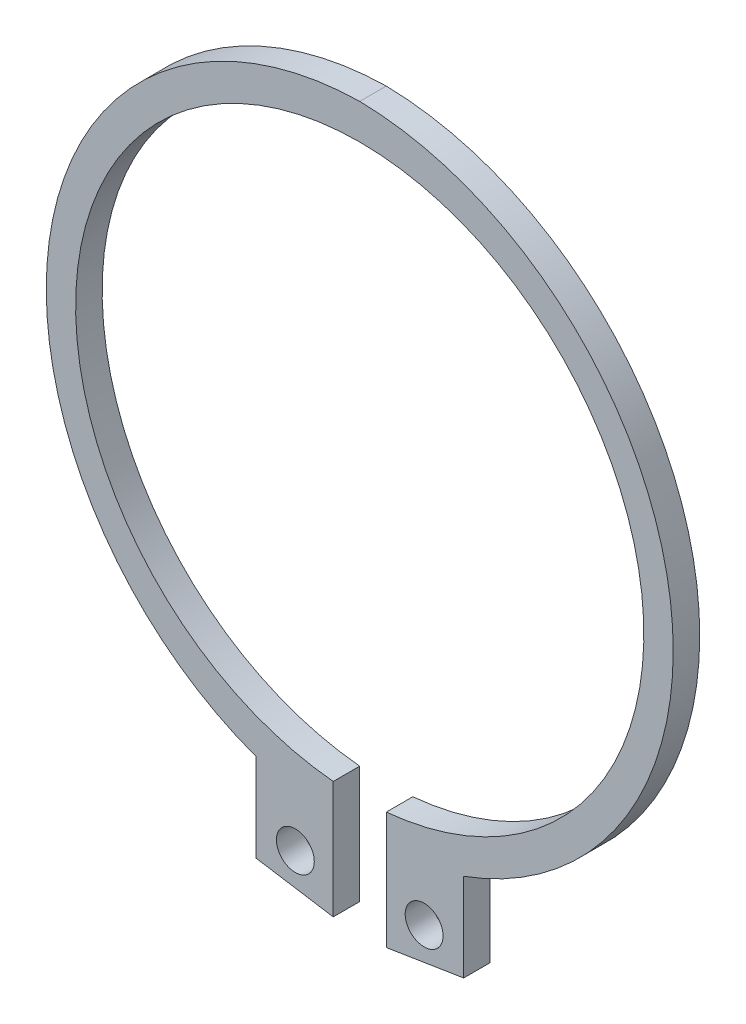
ISO-10303-21;
HEADER;
FILE_DESCRIPTION(('STEP AP214'),'2;1');
FILE_NAME('part.step','',(''),(''),'','','');
FILE_SCHEMA(('AUTOMOTIVE_DESIGN { 1 0 10303 214 1 1 1 1 }'));
ENDSEC;
DATA;
#1=APPLICATION_CONTEXT('core data for automotive mechanical design processes');
#2=APPLICATION_PROTOCOL_DEFINITION('international standard','automotive_design',2000,#1);
#3=PRODUCT_CONTEXT('',#1,'mechanical');
#4=PRODUCT('Part','Part','',(#3));
#5=PRODUCT_RELATED_PRODUCT_CATEGORY('part','',(#4));
#6=PRODUCT_DEFINITION_FORMATION('','',#4);
#7=PRODUCT_DEFINITION_CONTEXT('part definition',#1,'design');
#8=PRODUCT_DEFINITION('design','',#6,#7);
#9=PRODUCT_DEFINITION_SHAPE('','',#8);
#10=(LENGTH_UNIT() NAMED_UNIT(*) SI_UNIT(.MILLI.,.METRE.));
#11=(NAMED_UNIT(*) PLANE_ANGLE_UNIT() SI_UNIT($,.RADIAN.));
#12=(NAMED_UNIT(*) SI_UNIT($,.STERADIAN.) SOLID_ANGLE_UNIT());
#13=UNCERTAINTY_MEASURE_WITH_UNIT(LENGTH_MEASURE(1.E-05),#10,'distance_accuracy_value','');
#14=(GEOMETRIC_REPRESENTATION_CONTEXT(3) GLOBAL_UNCERTAINTY_ASSIGNED_CONTEXT((#13)) GLOBAL_UNIT_ASSIGNED_CONTEXT((#10,
#11,#12)) REPRESENTATION_CONTEXT('',''));
#15=CARTESIAN_POINT('',(0.,0.,0.));
#16=DIRECTION('',(0.,0.,1.));
#17=DIRECTION('',(1.,0.,0.));
#18=AXIS2_PLACEMENT_3D('',#15,#16,#17);
#19=CARTESIAN_POINT('',(4.25,-23.875,0.875));
#20=DIRECTION('',(0.,0.,-1.));
#21=DIRECTION('',(1.,0.,0.));
#22=AXIS2_PLACEMENT_3D('',#19,#20,#21);
#23=CYLINDRICAL_SURFACE('',#22,1.25);
#24=CARTESIAN_POINT('',(4.25,-23.875,0.));
#25=DIRECTION('',(0.,0.,1.));
#26=DIRECTION('',(1.,0.,0.));
#27=AXIS2_PLACEMENT_3D('',#24,#25,#26);
#28=CIRCLE('',#27,1.25);
#29=CARTESIAN_POINT('',(5.5,-23.875,0.));
#30=VERTEX_POINT('',#29);
#31=EDGE_CURVE('E33',#30,#30,#28,.T.);
#32=ORIENTED_EDGE('',*,*,#31,.F.);
#33=EDGE_LOOP('',(#32));
#34=FACE_BOUND('',#33,.T.);
#35=CARTESIAN_POINT('',(4.25,-23.875,1.75));
#36=DIRECTION('',(0.,0.,-1.));
#37=DIRECTION('',(1.,0.,0.));
#38=AXIS2_PLACEMENT_3D('',#35,#36,#37);
#39=CIRCLE('',#38,1.25);
#40=CARTESIAN_POINT('',(5.5,-23.875,1.75));
#41=VERTEX_POINT('',#40);
#42=EDGE_CURVE('E20',#41,#41,#39,.T.);
#43=ORIENTED_EDGE('',*,*,#42,.F.);
#44=EDGE_LOOP('',(#43));
#45=FACE_BOUND('',#44,.T.);
#46=ADVANCED_FACE('F16',(#34,#45),#23,.F.);
#47=CARTESIAN_POINT('',(-4.25,-23.875,0.875));
#48=DIRECTION('',(0.,0.,-1.));
#49=DIRECTION('',(1.,0.,0.));
#50=AXIS2_PLACEMENT_3D('',#47,#48,#49);
#51=CYLINDRICAL_SURFACE('',#50,1.25);
#52=CARTESIAN_POINT('',(-4.25,-23.875,0.));
#53=DIRECTION('',(0.,0.,1.));
#54=DIRECTION('',(1.,0.,0.));
#55=AXIS2_PLACEMENT_3D('',#52,#53,#54);
#56=CIRCLE('',#55,1.25);
#57=CARTESIAN_POINT('',(-3.,-23.875,0.));
#58=VERTEX_POINT('',#57);
#59=EDGE_CURVE('E155',#58,#58,#56,.T.);
#60=ORIENTED_EDGE('',*,*,#59,.F.);
#61=EDGE_LOOP('',(#60));
#62=FACE_BOUND('',#61,.T.);
#63=CARTESIAN_POINT('',(-4.25,-23.875,1.75));
#64=DIRECTION('',(0.,0.,-1.));
#65=DIRECTION('',(1.,0.,0.));
#66=AXIS2_PLACEMENT_3D('',#63,#64,#65);
#67=CIRCLE('',#66,1.25);
#68=CARTESIAN_POINT('',(-3.,-23.875,1.75));
#69=VERTEX_POINT('',#68);
#70=EDGE_CURVE('E139',#69,#69,#67,.T.);
#71=ORIENTED_EDGE('',*,*,#70,.F.);
#72=EDGE_LOOP('',(#71));
#73=FACE_BOUND('',#72,.T.);
#74=ADVANCED_FACE('F206',(#62,#73),#51,.F.);
#75=CARTESIAN_POINT('',(1.75,-15.,0.875));
#76=DIRECTION('',(-1.,0.,0.));
#77=DIRECTION('',(0.,0.,1.));
#78=AXIS2_PLACEMENT_3D('',#75,#76,#77);
#79=PLANE('',#78);
#80=DIRECTION('',(0.,0.,-1.));
#81=VECTOR('',#80,1.);
#82=CARTESIAN_POINT('',(1.75,-26.4102133568804,1.3125));
#83=LINE('',#82,#81);
#84=CARTESIAN_POINT('',(1.75,-26.4102133568804,1.75));
#85=VERTEX_POINT('',#84);
#86=CARTESIAN_POINT('',(1.75,-26.4102133568804,0.));
#87=VERTEX_POINT('',#86);
#88=EDGE_CURVE('E11',#85,#87,#83,.T.);
#89=ORIENTED_EDGE('',*,*,#88,.F.);
#90=DIRECTION('',(0.,-1.,0.));
#91=VECTOR('',#90,1.);
#92=CARTESIAN_POINT('',(1.75,-8.36192121621941,1.75));
#93=LINE('',#92,#91);
#94=CARTESIAN_POINT('',(1.75,-18.6681547025944,1.75));
#95=VERTEX_POINT('',#94);
#96=EDGE_CURVE('E133',#95,#85,#93,.T.);
#97=ORIENTED_EDGE('',*,*,#96,.F.);
#98=DIRECTION('',(0.,0.,1.));
#99=VECTOR('',#98,1.);
#100=CARTESIAN_POINT('',(1.75,-18.6681547025944,0.875));
#101=LINE('',#100,#99);
#102=CARTESIAN_POINT('',(1.75,-18.6681547025944,0.));
#103=VERTEX_POINT('',#102);
#104=EDGE_CURVE('E104',#103,#95,#101,.T.);
#105=ORIENTED_EDGE('',*,*,#104,.F.);
#106=DIRECTION('',(0.,1.,0.));
#107=VECTOR('',#106,1.);
#108=CARTESIAN_POINT('',(1.75,-8.36192121621941,0.));
#109=LINE('',#108,#107);
#110=EDGE_CURVE('E158',#87,#103,#109,.T.);
#111=ORIENTED_EDGE('',*,*,#110,.F.);
#112=EDGE_LOOP('',(#89,#97,#105,#111));
#113=FACE_BOUND('',#112,.T.);
#114=ADVANCED_FACE('F204',(#113),#79,.T.);
#115=CARTESIAN_POINT('',(-1.75,-15.,0.875));
#116=DIRECTION('',(1.,0.,0.));
#117=DIRECTION('',(0.,0.,-1.));
#118=AXIS2_PLACEMENT_3D('',#115,#116,#117);
#119=PLANE('',#118);
#120=DIRECTION('',(0.,0.,1.));
#121=VECTOR('',#120,1.);
#122=CARTESIAN_POINT('',(-1.75,-26.4102133568804,0.4375));
#123=LINE('',#122,#121);
#124=CARTESIAN_POINT('',(-1.75,-26.4102133568804,0.));
#125=VERTEX_POINT('',#124);
#126=CARTESIAN_POINT('',(-1.75,-26.4102133568804,1.75));
#127=VERTEX_POINT('',#126);
#128=EDGE_CURVE('E147',#125,#127,#123,.T.);
#129=ORIENTED_EDGE('',*,*,#128,.F.);
#130=DIRECTION('',(0.,-1.,0.));
#131=VECTOR('',#130,1.);
#132=CARTESIAN_POINT('',(-1.75,-8.36192121621941,0.));
#133=LINE('',#132,#131);
#134=CARTESIAN_POINT('',(-1.75,-18.6681547025944,0.));
#135=VERTEX_POINT('',#134);
#136=EDGE_CURVE('E179',#135,#125,#133,.T.);
#137=ORIENTED_EDGE('',*,*,#136,.F.);
#138=DIRECTION('',(0.,0.,-1.));
#139=VECTOR('',#138,1.);
#140=CARTESIAN_POINT('',(-1.75,-18.6681547025944,0.875));
#141=LINE('',#140,#139);
#142=CARTESIAN_POINT('',(-1.75,-18.6681547025944,1.75));
#143=VERTEX_POINT('',#142);
#144=EDGE_CURVE('E146',#143,#135,#141,.T.);
#145=ORIENTED_EDGE('',*,*,#144,.F.);
#146=DIRECTION('',(0.,1.,0.));
#147=VECTOR('',#146,1.);
#148=CARTESIAN_POINT('',(-1.75,-8.36192121621941,1.75));
#149=LINE('',#148,#147);
#150=EDGE_CURVE('E134',#127,#143,#149,.T.);
#151=ORIENTED_EDGE('',*,*,#150,.F.);
#152=EDGE_LOOP('',(#129,#137,#145,#151));
#153=FACE_BOUND('',#152,.T.);
#154=ADVANCED_FACE('F177',(#153),#119,.T.);
#155=CARTESIAN_POINT('',(4.2464374358677,-26.0128424929402,1.75));
#156=DIRECTION('',(0.157196211523257,-0.98756739065379,0.));
#157=DIRECTION('',(-0.98756739065379,-0.157196211523257,0.));
#158=AXIS2_PLACEMENT_3D('',#155,#156,#157);
#159=PLANE('',#158);
#160=ORIENTED_EDGE('',*,*,#88,.T.);
#161=DIRECTION('',(0.98756739065379,0.157196211523257,0.));
#162=VECTOR('',#161,1.);
#163=CARTESIAN_POINT('',(6.8587046952168,-25.5970343966603,0.));
#164=LINE('',#163,#162);
#165=CARTESIAN_POINT('',(6.8587046952168,-25.5970343966603,0.));
#166=VERTEX_POINT('',#165);
#167=EDGE_CURVE('E26',#87,#166,#164,.T.);
#168=ORIENTED_EDGE('',*,*,#167,.T.);
#169=DIRECTION('',(0.,0.,-1.));
#170=VECTOR('',#169,1.);
#171=CARTESIAN_POINT('',(6.8587046952168,-25.5970343966603,1.75));
#172=LINE('',#171,#170);
#173=CARTESIAN_POINT('',(6.8587046952168,-25.5970343966603,1.75));
#174=VERTEX_POINT('',#173);
#175=EDGE_CURVE('E115',#174,#166,#172,.T.);
#176=ORIENTED_EDGE('',*,*,#175,.F.);
#177=DIRECTION('',(-0.98756739065379,-0.157196211523257,0.));
#178=VECTOR('',#177,1.);
#179=CARTESIAN_POINT('',(6.8587046952168,-25.5970343966603,1.75));
#180=LINE('',#179,#178);
#181=EDGE_CURVE('E129',#174,#85,#180,.T.);
#182=ORIENTED_EDGE('',*,*,#181,.T.);
#183=EDGE_LOOP('',(#160,#168,#176,#182));
#184=FACE_BOUND('',#183,.T.);
#185=ADVANCED_FACE('F203',(#184),#159,.T.);
#186=CARTESIAN_POINT('',(-10.8697290850929,-1.72384243243881,0.));
#187=DIRECTION('',(0.,0.,1.));
#188=DIRECTION('',(1.,0.,0.));
#189=AXIS2_PLACEMENT_3D('',#186,#187,#188);
#190=PLANE('',#189);
#191=ORIENTED_EDGE('',*,*,#31,.T.);
#192=EDGE_LOOP('',(#191));
#193=FACE_BOUND('',#192,.T.);
#194=ORIENTED_EDGE('',*,*,#59,.T.);
#195=EDGE_LOOP('',(#194));
#196=FACE_BOUND('',#195,.T.);
#197=ORIENTED_EDGE('',*,*,#110,.T.);
#198=CARTESIAN_POINT('',(0.,0.,0.));
#199=DIRECTION('',(0.,0.,-1.));
#200=DIRECTION('',(-1.,0.,0.));
#201=AXIS2_PLACEMENT_3D('',#198,#199,#200);
#202=CIRCLE('',#201,18.75);
#203=EDGE_CURVE('E143',#135,#103,#202,.T.);
#204=ORIENTED_EDGE('',*,*,#203,.F.);
#205=ORIENTED_EDGE('',*,*,#136,.T.);
#206=DIRECTION('',(0.98756739065379,-0.157196211523257,0.));
#207=VECTOR('',#206,1.);
#208=CARTESIAN_POINT('',(-6.8587046952168,-25.5970343966603,0.));
#209=LINE('',#208,#207);
#210=CARTESIAN_POINT('',(-6.8587046952168,-25.5970343966603,0.));
#211=VERTEX_POINT('',#210);
#212=EDGE_CURVE('E121',#211,#125,#209,.T.);
#213=ORIENTED_EDGE('',*,*,#212,.F.);
#214=DIRECTION('',(0.,1.,0.));
#215=VECTOR('',#214,1.);
#216=CARTESIAN_POINT('',(-6.8587046952168,-25.5970343966603,0.));
#217=LINE('',#216,#215);
#218=CARTESIAN_POINT('',(-6.8587046952168,-19.7845343966603,0.));
#219=VERTEX_POINT('',#218);
#220=EDGE_CURVE('E181',#211,#219,#217,.T.);
#221=ORIENTED_EDGE('',*,*,#220,.T.);
#222=CARTESIAN_POINT('',(0.38630630968765,0.00473416812985732,0.));
#223=DIRECTION('',(0.,0.,1.));
#224=DIRECTION('',(1.,0.,0.));
#225=AXIS2_PLACEMENT_3D('',#222,#223,#224);
#226=CIRCLE('',#225,21.0738068414461);
#227=CARTESIAN_POINT('',(0.,21.075,0.));
#228=VERTEX_POINT('',#227);
#229=EDGE_CURVE('E99',#228,#219,#226,.T.);
#230=ORIENTED_EDGE('',*,*,#229,.F.);
#231=CARTESIAN_POINT('',(-0.38630630968765,0.00473416812985732,0.));
#232=DIRECTION('',(0.,0.,1.));
#233=DIRECTION('',(-1.,0.,0.));
#234=AXIS2_PLACEMENT_3D('',#231,#232,#233);
#235=CIRCLE('',#234,21.0738068414461);
#236=CARTESIAN_POINT('',(6.8587046952168,-19.7845343966603,0.));
#237=VERTEX_POINT('',#236);
#238=EDGE_CURVE('E192',#237,#228,#235,.T.);
#239=ORIENTED_EDGE('',*,*,#238,.F.);
#240=DIRECTION('',(0.,1.,0.));
#241=VECTOR('',#240,1.);
#242=CARTESIAN_POINT('',(6.8587046952168,-25.5970343966603,0.));
#243=LINE('',#242,#241);
#244=EDGE_CURVE('E136',#166,#237,#243,.T.);
#245=ORIENTED_EDGE('',*,*,#244,.F.);
#246=ORIENTED_EDGE('',*,*,#167,.F.);
#247=EDGE_LOOP('',(#197,#204,#205,#213,#221,#230,#239,#245,#246));
#248=FACE_BOUND('',#247,.T.);
#249=ADVANCED_FACE('F183',(#193,#196,#248),#190,.F.);
#250=CARTESIAN_POINT('',(-0.38630630968765,0.00473416812985732,1.75));
#251=DIRECTION('',(0.,0.,1.));
#252=DIRECTION('',(-1.,0.,0.));
#253=AXIS2_PLACEMENT_3D('',#250,#251,#252);
#254=CYLINDRICAL_SURFACE('',#253,21.0738068414461);
#255=ORIENTED_EDGE('',*,*,#238,.T.);
#256=DIRECTION('',(0.,0.,1.));
#257=VECTOR('',#256,1.);
#258=CARTESIAN_POINT('',(0.,21.075,0.));
#259=LINE('',#258,#257);
#260=CARTESIAN_POINT('',(0.,21.075,1.75));
#261=VERTEX_POINT('',#260);
#262=EDGE_CURVE('E141',#228,#261,#259,.T.);
#263=ORIENTED_EDGE('',*,*,#262,.T.);
#264=CARTESIAN_POINT('',(-0.38630630968765,0.00473416812985732,1.75));
#265=DIRECTION('',(0.,0.,-1.));
#266=DIRECTION('',(-1.,0.,0.));
#267=AXIS2_PLACEMENT_3D('',#264,#265,#266);
#268=CIRCLE('',#267,21.0738068414461);
#269=CARTESIAN_POINT('',(6.8587046952168,-19.7845343966603,1.75));
#270=VERTEX_POINT('',#269);
#271=EDGE_CURVE('E113',#261,#270,#268,.T.);
#272=ORIENTED_EDGE('',*,*,#271,.T.);
#273=DIRECTION('',(0.,0.,-1.));
#274=VECTOR('',#273,1.);
#275=CARTESIAN_POINT('',(6.8587046952168,-19.7845343966603,1.75));
#276=LINE('',#275,#274);
#277=EDGE_CURVE('E138',#270,#237,#276,.T.);
#278=ORIENTED_EDGE('',*,*,#277,.T.);
#279=EDGE_LOOP('',(#255,#263,#272,#278));
#280=FACE_BOUND('',#279,.T.);
#281=ADVANCED_FACE('F18',(#280),#254,.T.);
#282=CARTESIAN_POINT('',(6.8587046952168,-22.6907843966603,1.75));
#283=DIRECTION('',(1.,0.,0.));
#284=DIRECTION('',(0.,-1.,0.));
#285=AXIS2_PLACEMENT_3D('',#282,#283,#284);
#286=PLANE('',#285);
#287=ORIENTED_EDGE('',*,*,#244,.T.);
#288=ORIENTED_EDGE('',*,*,#277,.F.);
#289=DIRECTION('',(0.,1.,0.));
#290=VECTOR('',#289,1.);
#291=CARTESIAN_POINT('',(6.8587046952168,-25.5970343966603,1.75));
#292=LINE('',#291,#290);
#293=EDGE_CURVE('E132',#174,#270,#292,.T.);
#294=ORIENTED_EDGE('',*,*,#293,.F.);
#295=ORIENTED_EDGE('',*,*,#175,.T.);
#296=EDGE_LOOP('',(#287,#288,#294,#295));
#297=FACE_BOUND('',#296,.T.);
#298=ADVANCED_FACE('F201',(#297),#286,.T.);
#299=CARTESIAN_POINT('',(0.38630630968765,0.00473416812985732,0.));
#300=DIRECTION('',(0.,0.,-1.));
#301=DIRECTION('',(1.,0.,0.));
#302=AXIS2_PLACEMENT_3D('',#299,#300,#301);
#303=CYLINDRICAL_SURFACE('',#302,21.0738068414461);
#304=CARTESIAN_POINT('',(0.38630630968765,0.00473416812985732,1.75));
#305=DIRECTION('',(0.,0.,-1.));
#306=DIRECTION('',(1.,0.,0.));
#307=AXIS2_PLACEMENT_3D('',#304,#305,#306);
#308=CIRCLE('',#307,21.0738068414461);
#309=CARTESIAN_POINT('',(-6.8587046952168,-19.7845343966603,1.75));
#310=VERTEX_POINT('',#309);
#311=EDGE_CURVE('E98',#310,#261,#308,.T.);
#312=ORIENTED_EDGE('',*,*,#311,.T.);
#313=ORIENTED_EDGE('',*,*,#262,.F.);
#314=ORIENTED_EDGE('',*,*,#229,.T.);
#315=DIRECTION('',(0.,0.,1.));
#316=VECTOR('',#315,1.);
#317=CARTESIAN_POINT('',(-6.8587046952168,-19.7845343966603,0.));
#318=LINE('',#317,#316);
#319=EDGE_CURVE('E94',#219,#310,#318,.T.);
#320=ORIENTED_EDGE('',*,*,#319,.T.);
#321=EDGE_LOOP('',(#312,#313,#314,#320));
#322=FACE_BOUND('',#321,.T.);
#323=ADVANCED_FACE('F96',(#322),#303,.T.);
#324=CARTESIAN_POINT('',(0.,0.,0.));
#325=DIRECTION('',(0.,0.,-1.));
#326=DIRECTION('',(1.,0.,0.));
#327=AXIS2_PLACEMENT_3D('',#324,#325,#326);
#328=CYLINDRICAL_SURFACE('',#327,18.75);
#329=ORIENTED_EDGE('',*,*,#104,.T.);
#330=CARTESIAN_POINT('',(0.,0.,1.75));
#331=DIRECTION('',(0.,0.,-1.));
#332=DIRECTION('',(-1.,0.,0.));
#333=AXIS2_PLACEMENT_3D('',#330,#331,#332);
#334=CIRCLE('',#333,18.75);
#335=EDGE_CURVE('E149',#143,#95,#334,.T.);
#336=ORIENTED_EDGE('',*,*,#335,.F.);
#337=ORIENTED_EDGE('',*,*,#144,.T.);
#338=ORIENTED_EDGE('',*,*,#203,.T.);
#339=EDGE_LOOP('',(#329,#336,#337,#338));
#340=FACE_BOUND('',#339,.T.);
#341=ADVANCED_FACE('F166',(#340),#328,.F.);
#342=CARTESIAN_POINT('',(-4.2464374358677,-26.0128424929402,0.));
#343=DIRECTION('',(-0.157196211523257,-0.98756739065379,0.));
#344=DIRECTION('',(0.98756739065379,-0.157196211523257,0.));
#345=AXIS2_PLACEMENT_3D('',#342,#343,#344);
#346=PLANE('',#345);
#347=ORIENTED_EDGE('',*,*,#128,.T.);
#348=DIRECTION('',(-0.98756739065379,0.157196211523257,0.));
#349=VECTOR('',#348,1.);
#350=CARTESIAN_POINT('',(-6.8587046952168,-25.5970343966603,1.75));
#351=LINE('',#350,#349);
#352=CARTESIAN_POINT('',(-6.8587046952168,-25.5970343966603,1.75));
#353=VERTEX_POINT('',#352);
#354=EDGE_CURVE('E124',#127,#353,#351,.T.);
#355=ORIENTED_EDGE('',*,*,#354,.T.);
#356=DIRECTION('',(0.,0.,1.));
#357=VECTOR('',#356,1.);
#358=CARTESIAN_POINT('',(-6.8587046952168,-25.5970343966603,0.));
#359=LINE('',#358,#357);
#360=EDGE_CURVE('E119',#211,#353,#359,.T.);
#361=ORIENTED_EDGE('',*,*,#360,.F.);
#362=ORIENTED_EDGE('',*,*,#212,.T.);
#363=EDGE_LOOP('',(#347,#355,#361,#362));
#364=FACE_BOUND('',#363,.T.);
#365=ADVANCED_FACE('F196',(#364),#346,.T.);
#366=CARTESIAN_POINT('',(-6.8587046952168,-22.6907843966603,0.));
#367=DIRECTION('',(-1.,0.,0.));
#368=DIRECTION('',(0.,-1.,0.));
#369=AXIS2_PLACEMENT_3D('',#366,#367,#368);
#370=PLANE('',#369);
#371=DIRECTION('',(0.,1.,0.));
#372=VECTOR('',#371,1.);
#373=CARTESIAN_POINT('',(-6.8587046952168,-25.5970343966603,1.75));
#374=LINE('',#373,#372);
#375=EDGE_CURVE('E110',#353,#310,#374,.T.);
#376=ORIENTED_EDGE('',*,*,#375,.T.);
#377=ORIENTED_EDGE('',*,*,#319,.F.);
#378=ORIENTED_EDGE('',*,*,#220,.F.);
#379=ORIENTED_EDGE('',*,*,#360,.T.);
#380=EDGE_LOOP('',(#376,#377,#378,#379));
#381=FACE_BOUND('',#380,.T.);
#382=ADVANCED_FACE('F117',(#381),#370,.T.);
#383=CARTESIAN_POINT('',(-10.8697290850929,-1.72384243243881,1.75));
#384=DIRECTION('',(0.,0.,1.));
#385=DIRECTION('',(1.,0.,0.));
#386=AXIS2_PLACEMENT_3D('',#383,#384,#385);
#387=PLANE('',#386);
#388=ORIENTED_EDGE('',*,*,#42,.T.);
#389=EDGE_LOOP('',(#388));
#390=FACE_BOUND('',#389,.T.);
#391=ORIENTED_EDGE('',*,*,#70,.T.);
#392=EDGE_LOOP('',(#391));
#393=FACE_BOUND('',#392,.T.);
#394=ORIENTED_EDGE('',*,*,#96,.T.);
#395=ORIENTED_EDGE('',*,*,#181,.F.);
#396=ORIENTED_EDGE('',*,*,#293,.T.);
#397=ORIENTED_EDGE('',*,*,#271,.F.);
#398=ORIENTED_EDGE('',*,*,#311,.F.);
#399=ORIENTED_EDGE('',*,*,#375,.F.);
#400=ORIENTED_EDGE('',*,*,#354,.F.);
#401=ORIENTED_EDGE('',*,*,#150,.T.);
#402=ORIENTED_EDGE('',*,*,#335,.T.);
#403=EDGE_LOOP('',(#394,#395,#396,#397,#398,#399,#400,#401,#402));
#404=FACE_BOUND('',#403,.T.);
#405=ADVANCED_FACE('F108',(#390,#393,#404),#387,.T.);
#406=CLOSED_SHELL('',(#46,#74,#114,#154,#185,#249,#281,#298,#323,#341,#365,#382,#405));
#407=MANIFOLD_SOLID_BREP('B1',#406);
#408=ADVANCED_BREP_SHAPE_REPRESENTATION('',(#18,#407),#14);
#409=SHAPE_DEFINITION_REPRESENTATION(#9,#408);
ENDSEC;
END-ISO-10303-21;
